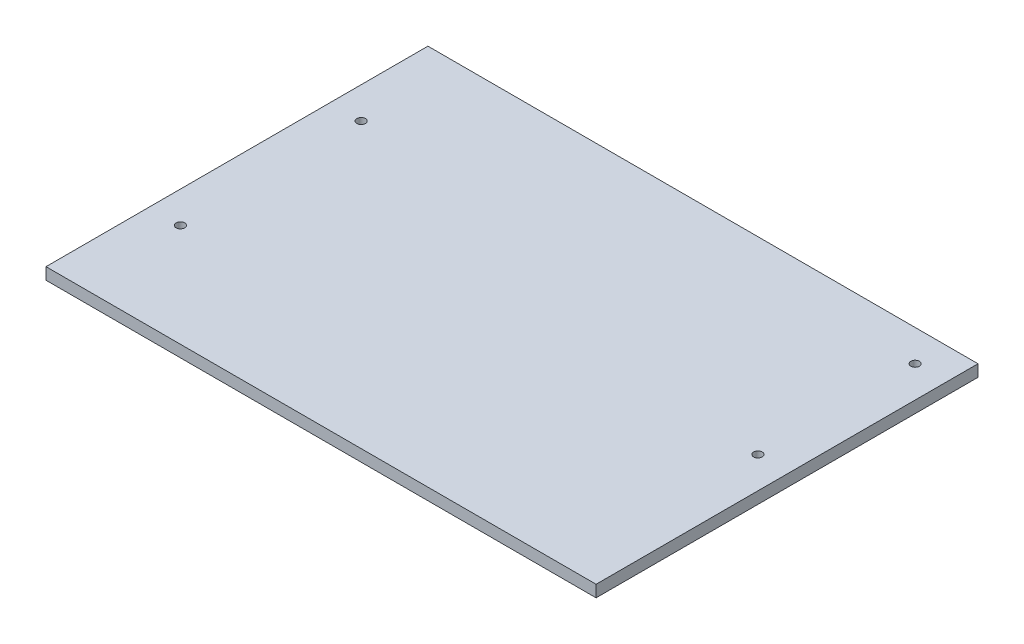
ISO-10303-21;
HEADER;
FILE_DESCRIPTION(('STEP AP214'),'2;1');
FILE_NAME('part.step','',(''),(''),'','','');
FILE_SCHEMA(('AUTOMOTIVE_DESIGN { 1 0 10303 214 1 1 1 1 }'));
ENDSEC;
DATA;
#1=APPLICATION_CONTEXT('core data for automotive mechanical design processes');
#2=APPLICATION_PROTOCOL_DEFINITION('international standard','automotive_design',2000,#1);
#3=PRODUCT_CONTEXT('',#1,'mechanical');
#4=PRODUCT('Part','Part','',(#3));
#5=PRODUCT_RELATED_PRODUCT_CATEGORY('part','',(#4));
#6=PRODUCT_DEFINITION_FORMATION('','',#4);
#7=PRODUCT_DEFINITION_CONTEXT('part definition',#1,'design');
#8=PRODUCT_DEFINITION('design','',#6,#7);
#9=PRODUCT_DEFINITION_SHAPE('','',#8);
#10=(LENGTH_UNIT() NAMED_UNIT(*) SI_UNIT(.MILLI.,.METRE.));
#11=(NAMED_UNIT(*) PLANE_ANGLE_UNIT() SI_UNIT($,.RADIAN.));
#12=(NAMED_UNIT(*) SI_UNIT($,.STERADIAN.) SOLID_ANGLE_UNIT());
#13=UNCERTAINTY_MEASURE_WITH_UNIT(LENGTH_MEASURE(1.E-05),#10,'distance_accuracy_value','');
#14=(GEOMETRIC_REPRESENTATION_CONTEXT(3) GLOBAL_UNCERTAINTY_ASSIGNED_CONTEXT((#13)) GLOBAL_UNIT_ASSIGNED_CONTEXT((#10,
#11,#12)) REPRESENTATION_CONTEXT('',''));
#15=CARTESIAN_POINT('',(0.,0.,0.));
#16=DIRECTION('',(0.,0.,1.));
#17=DIRECTION('',(1.,0.,0.));
#18=AXIS2_PLACEMENT_3D('',#15,#16,#17);
#19=CARTESIAN_POINT('',(-33.17728245926,2.447980609798,21.165515978186));
#20=DIRECTION('',(0.,1.,0.));
#21=DIRECTION('',(0.,0.,1.));
#22=AXIS2_PLACEMENT_3D('',#19,#20,#21);
#23=PLANE('',#22);
#24=CARTESIAN_POINT('',(-29.17728245926,2.447980609798,8.065515978186));
#25=DIRECTION('',(0.,1.,0.));
#26=DIRECTION('',(0.,0.,1.));
#27=AXIS2_PLACEMENT_3D('',#24,#25,#26);
#28=CIRCLE('',#27,0.55);
#29=CARTESIAN_POINT('',(-29.17728245926,2.447980609798,8.615515978186));
#30=VERTEX_POINT('',#29);
#31=EDGE_CURVE('E90',#30,#30,#28,.T.);
#32=ORIENTED_EDGE('',*,*,#31,.T.);
#33=EDGE_LOOP('',(#32));
#34=FACE_BOUND('',#33,.T.);
#35=CARTESIAN_POINT('',(32.822717540733,2.447980609798,-3.434484021814));
#36=DIRECTION('',(0.,1.,0.));
#37=DIRECTION('',(0.,0.,1.));
#38=AXIS2_PLACEMENT_3D('',#35,#36,#37);
#39=CIRCLE('',#38,0.55);
#40=CARTESIAN_POINT('',(32.822717540733,2.447980609798,-2.884484021814));
#41=VERTEX_POINT('',#40);
#42=EDGE_CURVE('E94',#41,#41,#39,.T.);
#43=ORIENTED_EDGE('',*,*,#42,.T.);
#44=EDGE_LOOP('',(#43));
#45=FACE_BOUND('',#44,.T.);
#46=CARTESIAN_POINT('',(32.822717540733,2.447980609798,-23.43448402181));
#47=DIRECTION('',(0.,1.,0.));
#48=DIRECTION('',(0.,0.,1.));
#49=AXIS2_PLACEMENT_3D('',#46,#47,#48);
#50=CIRCLE('',#49,0.55);
#51=CARTESIAN_POINT('',(32.822717540733,2.447980609798,-22.88448402181));
#52=VERTEX_POINT('',#51);
#53=EDGE_CURVE('E96',#52,#52,#50,.T.);
#54=ORIENTED_EDGE('',*,*,#53,.T.);
#55=EDGE_LOOP('',(#54));
#56=FACE_BOUND('',#55,.T.);
#57=CARTESIAN_POINT('',(-29.17728245926,2.447980609798,-14.93448402181));
#58=DIRECTION('',(0.,1.,0.));
#59=DIRECTION('',(0.,0.,1.));
#60=AXIS2_PLACEMENT_3D('',#57,#58,#59);
#61=CIRCLE('',#60,0.55);
#62=CARTESIAN_POINT('',(-29.17728245926,2.447980609798,-14.38448402181));
#63=VERTEX_POINT('',#62);
#64=EDGE_CURVE('E20',#63,#63,#61,.T.);
#65=ORIENTED_EDGE('',*,*,#64,.T.);
#66=EDGE_LOOP('',(#65));
#67=FACE_BOUND('',#66,.T.);
#68=DIRECTION('',(1.,0.,0.));
#69=VECTOR('',#68,1.);
#70=CARTESIAN_POINT('',(-33.17728245926,2.447980609798,-27.43448402181));
#71=LINE('',#70,#69);
#72=CARTESIAN_POINT('',(-33.17728245926,2.447980609798,-27.43448402181));
#73=VERTEX_POINT('',#72);
#74=CARTESIAN_POINT('',(36.822717540733,2.447980609798,-27.43448402181));
#75=VERTEX_POINT('',#74);
#76=EDGE_CURVE('E101',#73,#75,#71,.T.);
#77=ORIENTED_EDGE('',*,*,#76,.T.);
#78=DIRECTION('',(0.,0.,1.));
#79=VECTOR('',#78,1.);
#80=CARTESIAN_POINT('',(36.822717540733,2.447980609798,-27.43448402181));
#81=LINE('',#80,#79);
#82=CARTESIAN_POINT('',(36.822717540733,2.447980609798,21.165515978186));
#83=VERTEX_POINT('',#82);
#84=EDGE_CURVE('E70',#75,#83,#81,.T.);
#85=ORIENTED_EDGE('',*,*,#84,.T.);
#86=DIRECTION('',(-1.,0.,0.));
#87=VECTOR('',#86,1.);
#88=CARTESIAN_POINT('',(-33.17728245926,2.447980609798,21.165515978186));
#89=LINE('',#88,#87);
#90=CARTESIAN_POINT('',(-33.17728245926,2.447980609798,21.165515978186));
#91=VERTEX_POINT('',#90);
#92=EDGE_CURVE('E55',#83,#91,#89,.T.);
#93=ORIENTED_EDGE('',*,*,#92,.T.);
#94=DIRECTION('',(0.,0.,-1.));
#95=VECTOR('',#94,1.);
#96=CARTESIAN_POINT('',(-33.17728245926,2.447980609798,-27.43448402181));
#97=LINE('',#96,#95);
#98=EDGE_CURVE('E60',#91,#73,#97,.T.);
#99=ORIENTED_EDGE('',*,*,#98,.T.);
#100=EDGE_LOOP('',(#77,#85,#93,#99));
#101=FACE_BOUND('',#100,.T.);
#102=ADVANCED_FACE('F17',(#34,#45,#56,#67,#101),#23,.F.);
#103=CARTESIAN_POINT('',(-33.17728245926,3.947980609798,-27.43448402181));
#104=DIRECTION('',(1.,0.,0.));
#105=DIRECTION('',(0.,0.,-1.));
#106=AXIS2_PLACEMENT_3D('',#103,#104,#105);
#107=PLANE('',#106);
#108=DIRECTION('',(0.,1.,0.));
#109=VECTOR('',#108,1.);
#110=CARTESIAN_POINT('',(-33.17728245926,3.947980609798,21.165515978186));
#111=LINE('',#110,#109);
#112=CARTESIAN_POINT('',(-33.17728245926,3.947980609798,21.165515978186));
#113=VERTEX_POINT('',#112);
#114=EDGE_CURVE('E62',#91,#113,#111,.T.);
#115=ORIENTED_EDGE('',*,*,#114,.T.);
#116=DIRECTION('',(0.,0.,1.));
#117=VECTOR('',#116,1.);
#118=CARTESIAN_POINT('',(-33.17728245926,3.947980609798,21.165515978186));
#119=LINE('',#118,#117);
#120=CARTESIAN_POINT('',(-33.17728245926,3.947980609798,-27.43448402181));
#121=VERTEX_POINT('',#120);
#122=EDGE_CURVE('E93',#121,#113,#119,.T.);
#123=ORIENTED_EDGE('',*,*,#122,.F.);
#124=DIRECTION('',(0.,1.,0.));
#125=VECTOR('',#124,1.);
#126=CARTESIAN_POINT('',(-33.17728245926,3.947980609798,-27.43448402181));
#127=LINE('',#126,#125);
#128=EDGE_CURVE('E65',#121,#73,#127,.F.);
#129=ORIENTED_EDGE('',*,*,#128,.T.);
#130=ORIENTED_EDGE('',*,*,#98,.F.);
#131=EDGE_LOOP('',(#115,#123,#129,#130));
#132=FACE_BOUND('',#131,.T.);
#133=ADVANCED_FACE('F61',(#132),#107,.F.);
#134=CARTESIAN_POINT('',(-33.17728245926,3.947980609798,21.165515978186));
#135=DIRECTION('',(0.,0.,-1.));
#136=DIRECTION('',(-1.,0.,0.));
#137=AXIS2_PLACEMENT_3D('',#134,#135,#136);
#138=PLANE('',#137);
#139=DIRECTION('',(0.,1.,0.));
#140=VECTOR('',#139,1.);
#141=CARTESIAN_POINT('',(36.822717540733,3.947980609798,21.165515978186));
#142=LINE('',#141,#140);
#143=CARTESIAN_POINT('',(36.822717540733,3.947980609798,21.165515978186));
#144=VERTEX_POINT('',#143);
#145=EDGE_CURVE('E72',#83,#144,#142,.T.);
#146=ORIENTED_EDGE('',*,*,#145,.T.);
#147=DIRECTION('',(1.,0.,0.));
#148=VECTOR('',#147,1.);
#149=CARTESIAN_POINT('',(-33.17728245926,3.947980609798,21.165515978186));
#150=LINE('',#149,#148);
#151=EDGE_CURVE('E76',#113,#144,#150,.T.);
#152=ORIENTED_EDGE('',*,*,#151,.F.);
#153=ORIENTED_EDGE('',*,*,#114,.F.);
#154=ORIENTED_EDGE('',*,*,#92,.F.);
#155=EDGE_LOOP('',(#146,#152,#153,#154));
#156=FACE_BOUND('',#155,.T.);
#157=ADVANCED_FACE('F74',(#156),#138,.F.);
#158=CARTESIAN_POINT('',(36.822717540733,3.947980609798,-27.43448402181));
#159=DIRECTION('',(-1.,0.,0.));
#160=DIRECTION('',(0.,0.,1.));
#161=AXIS2_PLACEMENT_3D('',#158,#159,#160);
#162=PLANE('',#161);
#163=DIRECTION('',(0.,1.,0.));
#164=VECTOR('',#163,1.);
#165=CARTESIAN_POINT('',(36.822717540733,3.947980609798,-27.43448402181));
#166=LINE('',#165,#164);
#167=CARTESIAN_POINT('',(36.822717540733,3.947980609798,-27.43448402181));
#168=VERTEX_POINT('',#167);
#169=EDGE_CURVE('E35',#75,#168,#166,.T.);
#170=ORIENTED_EDGE('',*,*,#169,.T.);
#171=DIRECTION('',(0.,0.,1.));
#172=VECTOR('',#171,1.);
#173=CARTESIAN_POINT('',(36.822717540733,3.947980609798,21.165515978186));
#174=LINE('',#173,#172);
#175=EDGE_CURVE('E111',#144,#168,#174,.F.);
#176=ORIENTED_EDGE('',*,*,#175,.F.);
#177=ORIENTED_EDGE('',*,*,#145,.F.);
#178=ORIENTED_EDGE('',*,*,#84,.F.);
#179=EDGE_LOOP('',(#170,#176,#177,#178));
#180=FACE_BOUND('',#179,.T.);
#181=ADVANCED_FACE('F112',(#180),#162,.F.);
#182=CARTESIAN_POINT('',(-33.17728245926,3.947980609798,-27.43448402181));
#183=DIRECTION('',(0.,0.,1.));
#184=DIRECTION('',(1.,0.,0.));
#185=AXIS2_PLACEMENT_3D('',#182,#183,#184);
#186=PLANE('',#185);
#187=ORIENTED_EDGE('',*,*,#128,.F.);
#188=DIRECTION('',(1.,0.,0.));
#189=VECTOR('',#188,1.);
#190=CARTESIAN_POINT('',(-33.17728245926,3.947980609798,-27.43448402181));
#191=LINE('',#190,#189);
#192=EDGE_CURVE('E89',#168,#121,#191,.F.);
#193=ORIENTED_EDGE('',*,*,#192,.F.);
#194=ORIENTED_EDGE('',*,*,#169,.F.);
#195=ORIENTED_EDGE('',*,*,#76,.F.);
#196=EDGE_LOOP('',(#187,#193,#194,#195));
#197=FACE_BOUND('',#196,.T.);
#198=ADVANCED_FACE('F119',(#197),#186,.F.);
#199=CARTESIAN_POINT('',(-29.17728245926,3.947980609798,-14.93448402181));
#200=DIRECTION('',(0.,1.,0.));
#201=DIRECTION('',(0.,0.,1.));
#202=AXIS2_PLACEMENT_3D('',#199,#200,#201);
#203=CYLINDRICAL_SURFACE('',#202,0.55);
#204=CARTESIAN_POINT('',(-29.17728245926,3.947980609798,-14.93448402181));
#205=DIRECTION('',(0.,1.,0.));
#206=DIRECTION('',(0.,0.,1.));
#207=AXIS2_PLACEMENT_3D('',#204,#205,#206);
#208=CIRCLE('',#207,0.55);
#209=CARTESIAN_POINT('',(-29.17728245926,3.947980609798,-14.38448402181));
#210=VERTEX_POINT('',#209);
#211=EDGE_CURVE('E86',#210,#210,#208,.F.);
#212=ORIENTED_EDGE('',*,*,#211,.F.);
#213=EDGE_LOOP('',(#212));
#214=FACE_BOUND('',#213,.T.);
#215=ORIENTED_EDGE('',*,*,#64,.F.);
#216=EDGE_LOOP('',(#215));
#217=FACE_BOUND('',#216,.T.);
#218=ADVANCED_FACE('F121',(#214,#217),#203,.F.);
#219=CARTESIAN_POINT('',(32.822717540733,3.947980609798,-23.43448402181));
#220=DIRECTION('',(0.,1.,0.));
#221=DIRECTION('',(0.,0.,1.));
#222=AXIS2_PLACEMENT_3D('',#219,#220,#221);
#223=CYLINDRICAL_SURFACE('',#222,0.55);
#224=CARTESIAN_POINT('',(32.822717540733,3.947980609798,-23.43448402181));
#225=DIRECTION('',(0.,1.,0.));
#226=DIRECTION('',(0.,0.,1.));
#227=AXIS2_PLACEMENT_3D('',#224,#225,#226);
#228=CIRCLE('',#227,0.55);
#229=CARTESIAN_POINT('',(32.822717540733,3.947980609798,-22.88448402181));
#230=VERTEX_POINT('',#229);
#231=EDGE_CURVE('E83',#230,#230,#228,.F.);
#232=ORIENTED_EDGE('',*,*,#231,.F.);
#233=EDGE_LOOP('',(#232));
#234=FACE_BOUND('',#233,.T.);
#235=ORIENTED_EDGE('',*,*,#53,.F.);
#236=EDGE_LOOP('',(#235));
#237=FACE_BOUND('',#236,.T.);
#238=ADVANCED_FACE('F128',(#234,#237),#223,.F.);
#239=CARTESIAN_POINT('',(32.822717540733,3.947980609798,-3.434484021814));
#240=DIRECTION('',(0.,1.,0.));
#241=DIRECTION('',(0.,0.,1.));
#242=AXIS2_PLACEMENT_3D('',#239,#240,#241);
#243=CYLINDRICAL_SURFACE('',#242,0.55);
#244=CARTESIAN_POINT('',(32.822717540733,3.947980609798,-3.434484021814));
#245=DIRECTION('',(0.,1.,0.));
#246=DIRECTION('',(0.,0.,1.));
#247=AXIS2_PLACEMENT_3D('',#244,#245,#246);
#248=CIRCLE('',#247,0.55);
#249=CARTESIAN_POINT('',(32.822717540733,3.947980609798,-2.884484021814));
#250=VERTEX_POINT('',#249);
#251=EDGE_CURVE('E26',#250,#250,#248,.F.);
#252=ORIENTED_EDGE('',*,*,#251,.F.);
#253=EDGE_LOOP('',(#252));
#254=FACE_BOUND('',#253,.T.);
#255=ORIENTED_EDGE('',*,*,#42,.F.);
#256=EDGE_LOOP('',(#255));
#257=FACE_BOUND('',#256,.T.);
#258=ADVANCED_FACE('F139',(#254,#257),#243,.F.);
#259=CARTESIAN_POINT('',(-29.17728245926,3.947980609798,8.065515978186));
#260=DIRECTION('',(0.,1.,0.));
#261=DIRECTION('',(0.,0.,1.));
#262=AXIS2_PLACEMENT_3D('',#259,#260,#261);
#263=CYLINDRICAL_SURFACE('',#262,0.55);
#264=CARTESIAN_POINT('',(-29.17728245926,3.947980609798,8.065515978186));
#265=DIRECTION('',(0.,1.,0.));
#266=DIRECTION('',(0.,0.,1.));
#267=AXIS2_PLACEMENT_3D('',#264,#265,#266);
#268=CIRCLE('',#267,0.55);
#269=CARTESIAN_POINT('',(-29.17728245926,3.947980609798,8.615515978186));
#270=VERTEX_POINT('',#269);
#271=EDGE_CURVE('E11',#270,#270,#268,.F.);
#272=ORIENTED_EDGE('',*,*,#271,.F.);
#273=EDGE_LOOP('',(#272));
#274=FACE_BOUND('',#273,.T.);
#275=ORIENTED_EDGE('',*,*,#31,.F.);
#276=EDGE_LOOP('',(#275));
#277=FACE_BOUND('',#276,.T.);
#278=ADVANCED_FACE('F133',(#274,#277),#263,.F.);
#279=CARTESIAN_POINT('',(-33.17728245926,3.947980609798,21.165515978186));
#280=DIRECTION('',(0.,1.,0.));
#281=DIRECTION('',(0.,0.,1.));
#282=AXIS2_PLACEMENT_3D('',#279,#280,#281);
#283=PLANE('',#282);
#284=ORIENTED_EDGE('',*,*,#271,.T.);
#285=EDGE_LOOP('',(#284));
#286=FACE_BOUND('',#285,.T.);
#287=ORIENTED_EDGE('',*,*,#251,.T.);
#288=EDGE_LOOP('',(#287));
#289=FACE_BOUND('',#288,.T.);
#290=ORIENTED_EDGE('',*,*,#231,.T.);
#291=EDGE_LOOP('',(#290));
#292=FACE_BOUND('',#291,.T.);
#293=ORIENTED_EDGE('',*,*,#211,.T.);
#294=EDGE_LOOP('',(#293));
#295=FACE_BOUND('',#294,.T.);
#296=ORIENTED_EDGE('',*,*,#175,.T.);
#297=ORIENTED_EDGE('',*,*,#192,.T.);
#298=ORIENTED_EDGE('',*,*,#122,.T.);
#299=ORIENTED_EDGE('',*,*,#151,.T.);
#300=EDGE_LOOP('',(#296,#297,#298,#299));
#301=FACE_BOUND('',#300,.T.);
#302=ADVANCED_FACE('F116',(#286,#289,#292,#295,#301),#283,.T.);
#303=CLOSED_SHELL('',(#102,#133,#157,#181,#198,#218,#238,#258,#278,#302));
#304=MANIFOLD_SOLID_BREP('B1',#303);
#305=ADVANCED_BREP_SHAPE_REPRESENTATION('',(#18,#304),#14);
#306=SHAPE_DEFINITION_REPRESENTATION(#9,#305);
ENDSEC;
END-ISO-10303-21;
